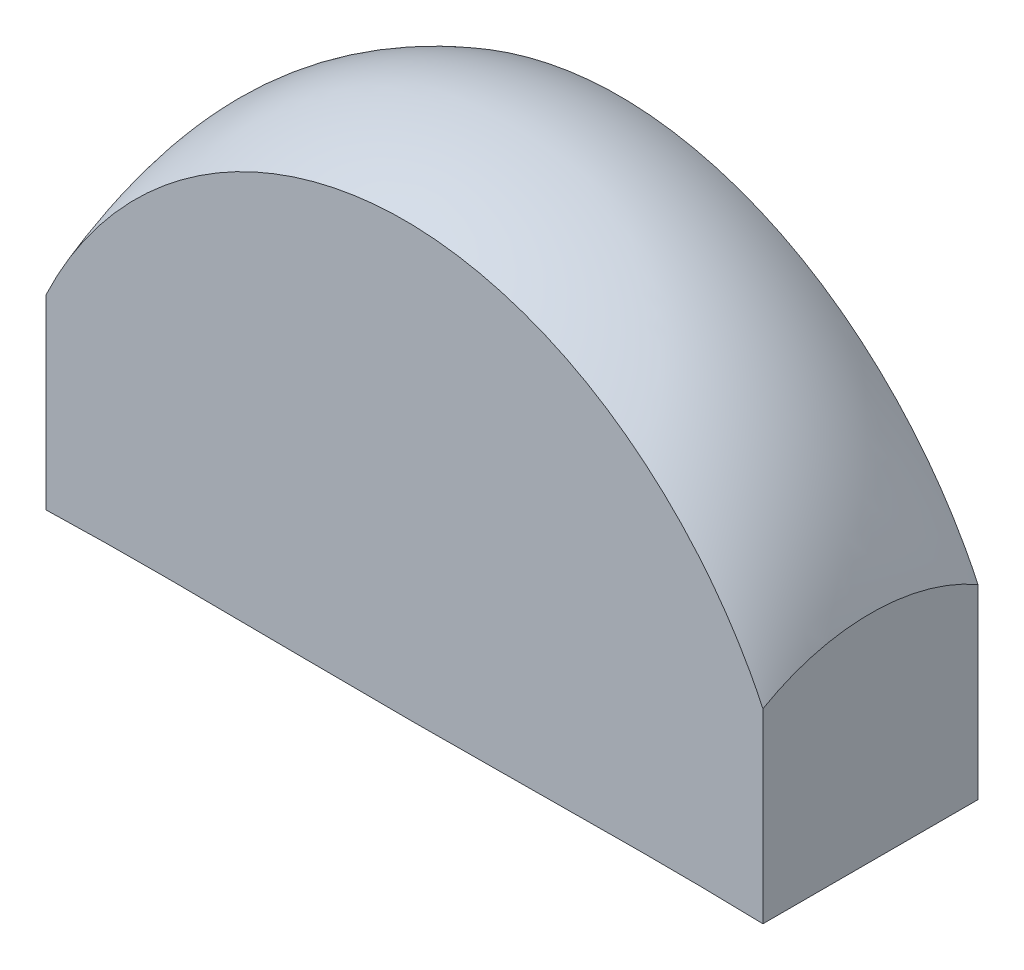
ISO-10303-21;
HEADER;
FILE_DESCRIPTION(('STEP AP214'),'2;1');
FILE_NAME('part.step','',(''),(''),'','','');
FILE_SCHEMA(('AUTOMOTIVE_DESIGN { 1 0 10303 214 1 1 1 1 }'));
ENDSEC;
DATA;
#1=APPLICATION_CONTEXT('core data for automotive mechanical design processes');
#2=APPLICATION_PROTOCOL_DEFINITION('international standard','automotive_design',2000,#1);
#3=PRODUCT_CONTEXT('',#1,'mechanical');
#4=PRODUCT('Part','Part','',(#3));
#5=PRODUCT_RELATED_PRODUCT_CATEGORY('part','',(#4));
#6=PRODUCT_DEFINITION_FORMATION('','',#4);
#7=PRODUCT_DEFINITION_CONTEXT('part definition',#1,'design');
#8=PRODUCT_DEFINITION('design','',#6,#7);
#9=PRODUCT_DEFINITION_SHAPE('','',#8);
#10=(LENGTH_UNIT() NAMED_UNIT(*) SI_UNIT(.MILLI.,.METRE.));
#11=(NAMED_UNIT(*) PLANE_ANGLE_UNIT() SI_UNIT($,.RADIAN.));
#12=(NAMED_UNIT(*) SI_UNIT($,.STERADIAN.) SOLID_ANGLE_UNIT());
#13=UNCERTAINTY_MEASURE_WITH_UNIT(LENGTH_MEASURE(1.E-05),#10,'distance_accuracy_value','');
#14=(GEOMETRIC_REPRESENTATION_CONTEXT(3) GLOBAL_UNCERTAINTY_ASSIGNED_CONTEXT((#13)) GLOBAL_UNIT_ASSIGNED_CONTEXT((#10,
#11,#12)) REPRESENTATION_CONTEXT('',''));
#15=CARTESIAN_POINT('',(0.,0.,0.));
#16=DIRECTION('',(0.,0.,1.));
#17=DIRECTION('',(1.,0.,0.));
#18=AXIS2_PLACEMENT_3D('',#15,#16,#17);
#19=CARTESIAN_POINT('',(100.,0.,0.));
#20=DIRECTION('',(1.,0.,0.));
#21=DIRECTION('',(0.,0.,-1.));
#22=AXIS2_PLACEMENT_3D('',#19,#20,#21);
#23=PLANE('',#22);
#24=DIRECTION('',(0.,1.,0.));
#25=VECTOR('',#24,1.);
#26=CARTESIAN_POINT('',(100.,0.,-15.));
#27=LINE('',#26,#25);
#28=CARTESIAN_POINT('',(100.,0.,-15.));
#29=VERTEX_POINT('',#28);
#30=CARTESIAN_POINT('',(100.,25.9807621135332,-15.));
#31=VERTEX_POINT('',#30);
#32=EDGE_CURVE('E198',#29,#31,#27,.T.);
#33=ORIENTED_EDGE('',*,*,#32,.T.);
#34=CARTESIAN_POINT('',(100.,0.,0.));
#35=DIRECTION('',(1.,0.,0.));
#36=DIRECTION('',(0.,0.,-1.));
#37=AXIS2_PLACEMENT_3D('',#34,#35,#36);
#38=CIRCLE('',#37,30.);
#39=CARTESIAN_POINT('',(100.,25.9807621135332,15.));
#40=VERTEX_POINT('',#39);
#41=EDGE_CURVE('E303',#31,#40,#38,.T.);
#42=ORIENTED_EDGE('',*,*,#41,.T.);
#43=DIRECTION('',(0.,1.,0.));
#44=VECTOR('',#43,1.);
#45=CARTESIAN_POINT('',(100.,0.,15.));
#46=LINE('',#45,#44);
#47=CARTESIAN_POINT('',(100.,0.,15.));
#48=VERTEX_POINT('',#47);
#49=EDGE_CURVE('E156',#48,#40,#46,.T.);
#50=ORIENTED_EDGE('',*,*,#49,.F.);
#51=DIRECTION('',(0.,0.,-1.));
#52=VECTOR('',#51,1.);
#53=CARTESIAN_POINT('',(100.,0.,15.));
#54=LINE('',#53,#52);
#55=EDGE_CURVE('E13',#48,#29,#54,.T.);
#56=ORIENTED_EDGE('',*,*,#55,.T.);
#57=EDGE_LOOP('',(#33,#42,#50,#56));
#58=FACE_BOUND('',#57,.T.);
#59=ADVANCED_FACE('F145',(#58),#23,.T.);
#60=CARTESIAN_POINT('',(0.,0.,0.));
#61=DIRECTION('',(-1.,0.,0.));
#62=DIRECTION('',(0.,0.,1.));
#63=AXIS2_PLACEMENT_3D('',#60,#61,#62);
#64=PLANE('',#63);
#65=DIRECTION('',(0.,1.,0.));
#66=VECTOR('',#65,1.);
#67=CARTESIAN_POINT('',(0.,0.,15.));
#68=LINE('',#67,#66);
#69=CARTESIAN_POINT('',(0.,0.,15.));
#70=VERTEX_POINT('',#69);
#71=CARTESIAN_POINT('',(0.,25.9807621135332,15.));
#72=VERTEX_POINT('',#71);
#73=EDGE_CURVE('E256',#70,#72,#68,.T.);
#74=ORIENTED_EDGE('',*,*,#73,.T.);
#75=CARTESIAN_POINT('',(0.,0.,0.));
#76=DIRECTION('',(-1.,0.,0.));
#77=DIRECTION('',(0.,0.,1.));
#78=AXIS2_PLACEMENT_3D('',#75,#76,#77);
#79=CIRCLE('',#78,30.);
#80=CARTESIAN_POINT('',(0.,25.9807621135332,-15.));
#81=VERTEX_POINT('',#80);
#82=EDGE_CURVE('E214',#72,#81,#79,.T.);
#83=ORIENTED_EDGE('',*,*,#82,.T.);
#84=DIRECTION('',(0.,1.,0.));
#85=VECTOR('',#84,1.);
#86=CARTESIAN_POINT('',(0.,0.,-15.));
#87=LINE('',#86,#85);
#88=CARTESIAN_POINT('',(0.,0.,-15.));
#89=VERTEX_POINT('',#88);
#90=EDGE_CURVE('E195',#89,#81,#87,.T.);
#91=ORIENTED_EDGE('',*,*,#90,.F.);
#92=DIRECTION('',(0.,0.,-1.));
#93=VECTOR('',#92,1.);
#94=CARTESIAN_POINT('',(0.,0.,15.));
#95=LINE('',#94,#93);
#96=EDGE_CURVE('E203',#70,#89,#95,.T.);
#97=ORIENTED_EDGE('',*,*,#96,.F.);
#98=EDGE_LOOP('',(#74,#83,#91,#97));
#99=FACE_BOUND('',#98,.T.);
#100=ADVANCED_FACE('F213',(#99),#64,.T.);
#101=CARTESIAN_POINT('',(0.,25.9807621135332,-15.));
#102=CARTESIAN_POINT('',(3.12234403557291,32.6489417969371,-15.));
#103=CARTESIAN_POINT('',(11.6053060488286,44.6542255606435,-15.));
#104=CARTESIAN_POINT('',(29.0987033197415,56.8856224808324,-15.));
#105=CARTESIAN_POINT('',(50.0000000000007,61.5571887595839,-15.));
#106=CARTESIAN_POINT('',(70.9012966802595,56.8856224808321,-15.));
#107=CARTESIAN_POINT('',(88.3946939511714,44.6542255606437,-15.));
#108=CARTESIAN_POINT('',(96.8776559644271,32.6489417969372,-15.));
#109=CARTESIAN_POINT('',(100.,25.9807621135332,-15.));
#110=CARTESIAN_POINT('',(0.,26.254775253395,-14.5253953198178));
#111=CARTESIAN_POINT('',(3.09055625997516,32.9732640819557,-14.4608467343613));
#112=CARTESIAN_POINT('',(11.5391838090571,45.0617768000187,-14.3317495634483));
#113=CARTESIAN_POINT('',(29.0433815906168,57.3670883856812,-14.1811361973832));
#114=CARTESIAN_POINT('',(50.0000000000006,62.0628798056542,-14.1165876119267));
#115=CARTESIAN_POINT('',(70.9566184093841,57.367088385681,-14.1811361973832));
#116=CARTESIAN_POINT('',(88.4608161909429,45.0617768000189,-14.3317495634483));
#117=CARTESIAN_POINT('',(96.9094437400249,32.9732640819558,-14.4608467343613));
#118=CARTESIAN_POINT('',(100.,26.254775253395,-14.5253953198178));
#119=CARTESIAN_POINT('',(0.,26.7959731924632,-13.5282885832487));
#120=CARTESIAN_POINT('',(3.02968248284089,33.5730621936593,-13.3855341295006));
#121=CARTESIAN_POINT('',(11.4125593311948,45.7454745764124,-13.1000252220043));
#122=CARTESIAN_POINT('',(28.937440154134,58.1042681967726,-12.7669314965918));
#123=CARTESIAN_POINT('',(50.0000000000006,62.80870876851,-12.6241770428437));
#124=CARTESIAN_POINT('',(71.0625598458669,58.1042681967723,-12.7669314965919));
#125=CARTESIAN_POINT('',(88.5874406688053,45.7454745764126,-13.1000252220042));
#126=CARTESIAN_POINT('',(96.9703175171591,33.5730621936593,-13.3855341295005));
#127=CARTESIAN_POINT('',(100.,26.7959731924631,-13.5282885832487));
#128=CARTESIAN_POINT('',(0.,27.5664648704241,-11.8851137677095));
#129=CARTESIAN_POINT('',(2.94743091273955,34.3858565850394,-11.6912740048707));
#130=CARTESIAN_POINT('',(11.2414665781614,46.5978791045053,-11.3035944791931));
#131=CARTESIAN_POINT('',(28.7942939604898,58.9428908308628,-10.8513016992358));
#132=CARTESIAN_POINT('',(50.0000000000004,63.6221411808309,-10.657461936397));
#133=CARTESIAN_POINT('',(71.2057060395107,58.9428908308626,-10.8513016992358));
#134=CARTESIAN_POINT('',(88.7585334218386,46.5978791045054,-11.303594479193));
#135=CARTESIAN_POINT('',(97.0525690872604,34.3858565850394,-11.6912740048707));
#136=CARTESIAN_POINT('',(100.,27.566464870424,-11.8851137677095));
#137=CARTESIAN_POINT('',(0.,28.2748311090692,-10.0906016594128));
#138=CARTESIAN_POINT('',(2.87519221165467,35.1093443297182,-9.89445898646243));
#139=CARTESIAN_POINT('',(11.0912017476064,47.3120920586174,-9.50217364056162));
#140=CARTESIAN_POINT('',(28.6685736237066,59.5935927924681,-9.04450740367725));
#141=CARTESIAN_POINT('',(50.0000000000005,64.2286879445188,-8.84836473072686));
#142=CARTESIAN_POINT('',(71.331426376294,59.593592792468,-9.0445074036773));
#143=CARTESIAN_POINT('',(88.9087982523938,47.3120920586175,-9.50217364056155));
#144=CARTESIAN_POINT('',(97.1248077883455,35.1093443297182,-9.89445898646241));
#145=CARTESIAN_POINT('',(100.,28.2748311090692,-10.0906016594128));
#146=CARTESIAN_POINT('',(0.,28.8919589723556,-8.16811682491327));
#147=CARTESIAN_POINT('',(2.81392015300254,35.7297883029387,-8.00078143771835));
#148=CARTESIAN_POINT('',(10.9637487982475,47.9056496933095,-7.6661106633285));
#149=CARTESIAN_POINT('',(28.5619390395645,60.1110916210149,-7.27566142654027));
#150=CARTESIAN_POINT('',(50.0000000000002,64.6992250454049,-7.10832603934536));
#151=CARTESIAN_POINT('',(71.4380609604358,60.1110916210148,-7.27566142654032));
#152=CARTESIAN_POINT('',(89.0362512017526,47.9056496933095,-7.66611066332844));
#153=CARTESIAN_POINT('',(97.1860798469976,35.7297883029387,-8.00078143771832));
#154=CARTESIAN_POINT('',(100.,28.8919589723556,-8.16811682491326));
#155=CARTESIAN_POINT('',(0.,29.3887355242406,-6.14102383076521));
#156=CARTESIAN_POINT('',(2.76456851019961,36.2256014631852,-6.02389869620077));
#157=CARTESIAN_POINT('',(10.8610916888031,48.3725385128664,-5.78964842707188));
#158=CARTESIAN_POINT('',(28.4760501038443,60.508238633217,-5.51635644642146));
#159=CARTESIAN_POINT('',(50.0000000000002,65.0549123298494,-5.39923131185702));
#160=CARTESIAN_POINT('',(71.523949896156,60.5082386332169,-5.51635644642149));
#161=CARTESIAN_POINT('',(89.138908311197,48.3725385128664,-5.78964842707184));
#162=CARTESIAN_POINT('',(97.2354314898005,36.2256014631852,-6.02389869620075));
#163=CARTESIAN_POINT('',(100.,29.3887355242406,-6.1410238307652));
#164=CARTESIAN_POINT('',(0.,29.7489356175491,-4.06535793203454));
#165=CARTESIAN_POINT('',(2.7280910566622,36.5855450060605,-4.00406258346366));
#166=CARTESIAN_POINT('',(10.785214377991,48.7120141551924,-3.8814718863219));
#167=CARTESIAN_POINT('',(28.4125667123264,60.7972286586586,-3.73844940632315));
#168=CARTESIAN_POINT('',(50.0000000000002,65.3137136053337,-3.67715405775228));
#169=CARTESIAN_POINT('',(71.5874332876738,60.7972286586586,-3.73844940632317));
#170=CARTESIAN_POINT('',(89.214785622009,48.7120141551924,-3.88147188632188));
#171=CARTESIAN_POINT('',(97.2719089433377,36.5855450060604,-4.00406258346366));
#172=CARTESIAN_POINT('',(99.9999999999999,29.7489356175491,-4.06535793203454));
#173=CARTESIAN_POINT('',(0.,29.9563341051062,-1.99715438378717));
#174=CARTESIAN_POINT('',(2.70544156580665,36.7957847762619,-1.98244385636733));
#175=CARTESIAN_POINT('',(10.7381008245293,48.9155462054761,-1.95302280152764));
#176=CARTESIAN_POINT('',(28.3731487607912,60.9764146554293,-1.918698237548));
#177=CARTESIAN_POINT('',(50.0000000000001,65.477155456939,-1.90398771012816));
#178=CARTESIAN_POINT('',(71.6268512392089,60.9764146554293,-1.91869823754801));
#179=CARTESIAN_POINT('',(89.2618991754708,48.9155462054761,-1.95302280152764));
#180=CARTESIAN_POINT('',(97.2945584341933,36.7957847762619,-1.98244385636733));
#181=CARTESIAN_POINT('',(99.9999999999999,29.9563341051062,-1.99715438378717));
#182=CARTESIAN_POINT('',(0.,30.,-0.654498463059296));
#183=CARTESIAN_POINT('',(2.70019639596844,36.841379922893,-0.654498463059296));
#184=CARTESIAN_POINT('',(10.7271902662671,48.9621305129254,-0.654498463059296));
#185=CARTESIAN_POINT('',(28.3640203502765,61.0203271936251,-0.654498463059295));
#186=CARTESIAN_POINT('',(50.,65.5186932328877,-0.654498463059295));
#187=CARTESIAN_POINT('',(71.6359796497235,61.0203271936251,-0.654498463059295));
#188=CARTESIAN_POINT('',(89.272809733733,48.9621305129254,-0.654498463059296));
#189=CARTESIAN_POINT('',(97.2998036040316,36.841379922893,-0.654498463059296));
#190=CARTESIAN_POINT('',(100.,30.,-0.654498463059293));
#191=CARTESIAN_POINT('',(0.,30.,0.));
#192=CARTESIAN_POINT('',(2.70019639596844,36.841379922893,0.));
#193=CARTESIAN_POINT('',(10.7271902662671,48.9621305129254,0.));
#194=CARTESIAN_POINT('',(28.3640203502765,61.0203271936251,0.));
#195=CARTESIAN_POINT('',(50.,65.5186932328877,0.));
#196=CARTESIAN_POINT('',(71.6359796497235,61.0203271936251,0.));
#197=CARTESIAN_POINT('',(89.272809733733,48.9621305129254,0.));
#198=CARTESIAN_POINT('',(97.2998036040316,36.841379922893,0.));
#199=CARTESIAN_POINT('',(100.,30.,0.));
#200=CARTESIAN_POINT('',(0.,30.,0.654498463059296));
#201=CARTESIAN_POINT('',(2.70019639596844,36.841379922893,0.654498463059297));
#202=CARTESIAN_POINT('',(10.7271902662671,48.9621305129254,0.654498463059297));
#203=CARTESIAN_POINT('',(28.3640203502765,61.0203271936251,0.654498463059296));
#204=CARTESIAN_POINT('',(50.,65.5186932328877,0.654498463059296));
#205=CARTESIAN_POINT('',(71.6359796497235,61.0203271936251,0.654498463059296));
#206=CARTESIAN_POINT('',(89.272809733733,48.9621305129254,0.654498463059297));
#207=CARTESIAN_POINT('',(97.2998036040316,36.841379922893,0.654498463059297));
#208=CARTESIAN_POINT('',(100.,30.,0.6544984630593));
#209=CARTESIAN_POINT('',(0.,29.9563341051062,1.99715438378717));
#210=CARTESIAN_POINT('',(2.70544156580665,36.795784776262,1.98244385636733));
#211=CARTESIAN_POINT('',(10.7381008245292,48.9155462054761,1.95302280152765));
#212=CARTESIAN_POINT('',(28.3731487607911,60.9764146554294,1.91869823754802));
#213=CARTESIAN_POINT('',(50.0000000000001,65.477155456939,1.90398771012818));
#214=CARTESIAN_POINT('',(71.6268512392089,60.9764146554293,1.91869823754802));
#215=CARTESIAN_POINT('',(89.2618991754708,48.9155462054761,1.95302280152764));
#216=CARTESIAN_POINT('',(97.2945584341934,36.7957847762619,1.98244385636733));
#217=CARTESIAN_POINT('',(100.,29.9563341051062,1.99715438378717));
#218=CARTESIAN_POINT('',(0.,29.748935617549,4.06535793203454));
#219=CARTESIAN_POINT('',(2.72809105666217,36.5855450060604,4.00406258346366));
#220=CARTESIAN_POINT('',(10.7852143779909,48.7120141551924,3.88147188632189));
#221=CARTESIAN_POINT('',(28.4125667123262,60.7972286586585,3.73844940632314));
#222=CARTESIAN_POINT('',(50.,65.3137136053337,3.67715405775226));
#223=CARTESIAN_POINT('',(71.5874332876736,60.7972286586585,3.73844940632315));
#224=CARTESIAN_POINT('',(89.2147856220091,48.7120141551924,3.88147188632187));
#225=CARTESIAN_POINT('',(97.2719089433379,36.5855450060604,4.00406258346365));
#226=CARTESIAN_POINT('',(100.,29.748935617549,4.06535793203454));
#227=CARTESIAN_POINT('',(0.,29.3887355242405,6.14102383076519));
#228=CARTESIAN_POINT('',(2.76456851019961,36.2256014631852,6.02389869620075));
#229=CARTESIAN_POINT('',(10.861091688803,48.3725385128664,5.78964842707188));
#230=CARTESIAN_POINT('',(28.4760501038442,60.508238633217,5.51635644642147));
#231=CARTESIAN_POINT('',(50.0000000000001,65.0549123298495,5.39923131185704));
#232=CARTESIAN_POINT('',(71.5239498961558,60.508238633217,5.51635644642151));
#233=CARTESIAN_POINT('',(89.138908311197,48.3725385128664,5.78964842707184));
#234=CARTESIAN_POINT('',(97.2354314898004,36.2256014631852,6.02389869620074));
#235=CARTESIAN_POINT('',(100.,29.3887355242405,6.1410238307652));
#236=CARTESIAN_POINT('',(0.,28.8919589723556,8.16811682491325));
#237=CARTESIAN_POINT('',(2.81392015300254,35.7297883029387,8.00078143771833));
#238=CARTESIAN_POINT('',(10.9637487982475,47.9056496933095,7.66611066332848));
#239=CARTESIAN_POINT('',(28.5619390395644,60.1110916210148,7.27566142654026));
#240=CARTESIAN_POINT('',(50.0000000000001,64.6992250454048,7.10832603934536));
#241=CARTESIAN_POINT('',(71.4380609604355,60.1110916210147,7.27566142654031));
#242=CARTESIAN_POINT('',(89.0362512017525,47.9056496933095,7.66611066332844));
#243=CARTESIAN_POINT('',(97.1860798469974,35.7297883029387,8.00078143771832));
#244=CARTESIAN_POINT('',(99.9999999999999,28.8919589723556,8.16811682491326));
#245=CARTESIAN_POINT('',(0.,28.2748311090691,10.0906016594128));
#246=CARTESIAN_POINT('',(2.87519221165464,35.1093443297182,9.89445898646242));
#247=CARTESIAN_POINT('',(11.0912017476063,47.3120920586175,9.50217364056161));
#248=CARTESIAN_POINT('',(28.6685736237065,59.5935927924682,9.04450740367724));
#249=CARTESIAN_POINT('',(50.0000000000002,64.2286879445188,8.84836473072685));
#250=CARTESIAN_POINT('',(71.3314263762937,59.593592792468,9.0445074036773));
#251=CARTESIAN_POINT('',(88.9087982523937,47.3120920586176,9.50217364056155));
#252=CARTESIAN_POINT('',(97.1248077883454,35.1093443297182,9.8944589864624));
#253=CARTESIAN_POINT('',(100.,28.2748311090691,10.0906016594128));
#254=CARTESIAN_POINT('',(0.,27.566464870424,11.8851137677095));
#255=CARTESIAN_POINT('',(2.94743091273952,34.3858565850394,11.6912740048707));
#256=CARTESIAN_POINT('',(11.2414665781613,46.5978791045053,11.3035944791931));
#257=CARTESIAN_POINT('',(28.7942939604897,58.9428908308627,10.8513016992358));
#258=CARTESIAN_POINT('',(50.0000000000002,63.6221411808309,10.657461936397));
#259=CARTESIAN_POINT('',(71.2057060395104,58.9428908308625,10.8513016992358));
#260=CARTESIAN_POINT('',(88.7585334218386,46.5978791045054,11.303594479193));
#261=CARTESIAN_POINT('',(97.0525690872605,34.3858565850394,11.6912740048706));
#262=CARTESIAN_POINT('',(100.,27.566464870424,11.8851137677095));
#263=CARTESIAN_POINT('',(0.,26.7959731924632,13.5282885832487));
#264=CARTESIAN_POINT('',(3.02968248284087,33.5730621936593,13.3855341295005));
#265=CARTESIAN_POINT('',(11.4125593311947,45.7454745764125,13.1000252220043));
#266=CARTESIAN_POINT('',(28.9374401541337,58.1042681967726,12.7669314965918));
#267=CARTESIAN_POINT('',(50.0000000000003,62.80870876851,12.6241770428437));
#268=CARTESIAN_POINT('',(71.0625598458666,58.1042681967724,12.7669314965919));
#269=CARTESIAN_POINT('',(88.5874406688053,45.7454745764126,13.1000252220042));
#270=CARTESIAN_POINT('',(96.9703175171592,33.5730621936593,13.3855341295005));
#271=CARTESIAN_POINT('',(100.,26.7959731924632,13.5282885832487));
#272=CARTESIAN_POINT('',(0.,26.254775253395,14.5253953198178));
#273=CARTESIAN_POINT('',(3.09055625997513,32.9732640819557,14.4608467343613));
#274=CARTESIAN_POINT('',(11.539183809057,45.0617768000187,14.3317495634483));
#275=CARTESIAN_POINT('',(29.0433815906166,57.3670883856813,14.1811361973832));
#276=CARTESIAN_POINT('',(50.0000000000003,62.0628798056542,14.1165876119267));
#277=CARTESIAN_POINT('',(70.9566184093838,57.367088385681,14.1811361973832));
#278=CARTESIAN_POINT('',(88.4608161909429,45.061776800019,14.3317495634483));
#279=CARTESIAN_POINT('',(96.9094437400249,32.9732640819558,14.4608467343613));
#280=CARTESIAN_POINT('',(100.,26.254775253395,14.5253953198178));
#281=CARTESIAN_POINT('',(0.,25.9807621135332,15.));
#282=CARTESIAN_POINT('',(3.12234403557289,32.6489417969371,15.));
#283=CARTESIAN_POINT('',(11.6053060488286,44.6542255606435,15.));
#284=CARTESIAN_POINT('',(29.0987033197413,56.8856224808324,15.));
#285=CARTESIAN_POINT('',(50.0000000000004,61.5571887595839,15.));
#286=CARTESIAN_POINT('',(70.9012966802591,56.8856224808321,15.));
#287=CARTESIAN_POINT('',(88.3946939511714,44.6542255606437,15.));
#288=CARTESIAN_POINT('',(96.8776559644271,32.6489417969372,15.));
#289=CARTESIAN_POINT('',(100.,25.9807621135332,15.));
#290=B_SPLINE_SURFACE_WITH_KNOTS('',3,3,((#101,#102,#103,#104,#105,#106,#107,#108,#109),(#110,
#111,#112,#113,#114,#115,#116,#117,#118),(#119,#120,#121,#122,#123,#124,#125,#126,#127),(#128,
#129,#130,#131,#132,#133,#134,#135,#136),(#137,#138,#139,#140,#141,#142,#143,#144,#145),(#146,
#147,#148,#149,#150,#151,#152,#153,#154),(#155,#156,#157,#158,#159,#160,#161,#162,#163),(#164,
#165,#166,#167,#168,#169,#170,#171,#172),(#173,#174,#175,#176,#177,#178,#179,#180,#181),(#182,
#183,#184,#185,#186,#187,#188,#189,#190),(#191,#192,#193,#194,#195,#196,#197,#198,#199),(#200,
#201,#202,#203,#204,#205,#206,#207,#208),(#209,#210,#211,#212,#213,#214,#215,#216,#217),(#218,
#219,#220,#221,#222,#223,#224,#225,#226),(#227,#228,#229,#230,#231,#232,#233,#234,#235),(#236,
#237,#238,#239,#240,#241,#242,#243,#244),(#245,#246,#247,#248,#249,#250,#251,#252,#253),(#254,
#255,#256,#257,#258,#259,#260,#261,#262),(#263,#264,#265,#266,#267,#268,#269,#270,#271),(#272,
#273,#274,#275,#276,#277,#278,#279,#280),(#281,#282,#283,#284,#285,#286,#287,#288,#289)),
.UNSPECIFIED.,.F.,.F.,.F.,(4,1,1,1,1,1,1,1,3,1,1,1,1,1,1,1,4),(4,1,1,1,1,1,4),
(0.757548768160034,0.772701970150032,0.78785517214003,0.803008374130028,0.818161576120026,
0.833314778110024,0.848467980100022,0.863621182090019,0.878774384080017,0.893927586070015,
0.909080788060013,0.924233990050011,0.939387192040009,0.954540394030007,0.969693596020004,
0.984846798010002,1.),(0.,0.166666666666667,0.333333333333333,0.500000000000072,
0.666666666666667,0.833333333333333,1.),.UNSPECIFIED.);
#291=CARTESIAN_POINT('',(0.,25.9807621135332,15.));
#292=CARTESIAN_POINT('',(3.12234403557289,32.6489417969371,15.));
#293=CARTESIAN_POINT('',(11.6053060488286,44.6542255606435,15.));
#294=CARTESIAN_POINT('',(29.0987033197413,56.8856224808324,15.));
#295=CARTESIAN_POINT('',(50.0000000000004,61.5571887595839,15.));
#296=CARTESIAN_POINT('',(70.9012966802591,56.8856224808321,15.));
#297=CARTESIAN_POINT('',(88.3946939511714,44.6542255606437,15.));
#298=CARTESIAN_POINT('',(96.8776559644271,32.6489417969372,15.));
#299=CARTESIAN_POINT('',(100.,25.9807621135332,15.));
#300=B_SPLINE_CURVE_WITH_KNOTS('',3,(#291,#292,#293,#294,#295,#296,#297,#298,#299),
.UNSPECIFIED.,.F.,.F.,(4,1,1,1,1,1,4),(0.,0.166666666666667,0.333333333333333,0.500000000000072,
0.666666666666667,0.833333333333333,1.),.UNSPECIFIED.);
#301=EDGE_CURVE('E345',#72,#40,#300,.T.);
#302=CARTESIAN_POINT('',(0.,25.9807621135332,-15.));
#303=CARTESIAN_POINT('',(3.12234403557291,32.6489417969371,-15.));
#304=CARTESIAN_POINT('',(11.6053060488286,44.6542255606435,-15.));
#305=CARTESIAN_POINT('',(29.0987033197415,56.8856224808324,-15.));
#306=CARTESIAN_POINT('',(50.0000000000007,61.5571887595839,-15.));
#307=CARTESIAN_POINT('',(70.9012966802595,56.8856224808321,-15.));
#308=CARTESIAN_POINT('',(88.3946939511714,44.6542255606437,-15.));
#309=CARTESIAN_POINT('',(96.8776559644271,32.6489417969372,-15.));
#310=CARTESIAN_POINT('',(100.,25.9807621135332,-15.));
#311=B_SPLINE_CURVE_WITH_KNOTS('',3,(#302,#303,#304,#305,#306,#307,#308,#309,#310),
.UNSPECIFIED.,.F.,.F.,(4,1,1,1,1,1,4),(0.,0.166666666666667,0.333333333333333,0.500000000000072,
0.666666666666667,0.833333333333333,1.),.UNSPECIFIED.);
#312=EDGE_CURVE('E201',#81,#31,#311,.T.);
#313=ORIENTED_EDGE('',*,*,#82,.F.);
#314=ORIENTED_EDGE('',*,*,#301,.T.);
#315=ORIENTED_EDGE('',*,*,#41,.F.);
#316=ORIENTED_EDGE('',*,*,#312,.F.);
#317=EDGE_LOOP('',(#313,#314,#315,#316));
#318=FACE_BOUND('',#317,.T.);
#319=ADVANCED_FACE('F233',(#318),#290,.T.);
#320=CARTESIAN_POINT('',(0.,0.,-15.));
#321=DIRECTION('',(0.,0.,-1.));
#322=DIRECTION('',(0.,1.,0.));
#323=AXIS2_PLACEMENT_3D('',#320,#321,#322);
#324=PLANE('',#323);
#325=ORIENTED_EDGE('',*,*,#90,.T.);
#326=ORIENTED_EDGE('',*,*,#312,.T.);
#327=ORIENTED_EDGE('',*,*,#32,.F.);
#328=CARTESIAN_POINT('',(0.,0.,-15.));
#329=CARTESIAN_POINT('',(5.16725805801291,0.159312082451496,-15.));
#330=CARTESIAN_POINT('',(15.8589630840035,0.265520137419212,-15.));
#331=CARTESIAN_POINT('',(32.6575613242877,0.106208054967527,-15.));
#332=CARTESIAN_POINT('',(50.0000000000022,-0.0531040274838209,-15.));
#333=CARTESIAN_POINT('',(67.3424386757166,0.106208054967747,-15.));
#334=CARTESIAN_POINT('',(84.1410369159966,0.265520137418985,-15.));
#335=CARTESIAN_POINT('',(94.8327419419871,0.159312082451419,-15.));
#336=CARTESIAN_POINT('',(100.,0.,-15.));
#337=B_SPLINE_CURVE_WITH_KNOTS('',3,(#328,#329,#330,#331,#332,#333,#334,#335,#336),
.UNSPECIFIED.,.F.,.F.,(4,1,1,1,1,1,4),(0.,0.166666666666667,0.333333333333333,0.500000000000072,
0.666666666666667,0.833333333333333,1.),.UNSPECIFIED.);
#338=EDGE_CURVE('E190',#89,#29,#337,.T.);
#339=ORIENTED_EDGE('',*,*,#338,.F.);
#340=EDGE_LOOP('',(#325,#326,#327,#339));
#341=FACE_BOUND('',#340,.T.);
#342=ADVANCED_FACE('F192',(#341),#324,.T.);
#343=CARTESIAN_POINT('',(0.,0.,15.));
#344=CARTESIAN_POINT('',(5.16725805801291,0.159312082451496,15.));
#345=CARTESIAN_POINT('',(15.8589630840034,0.265520137419213,15.));
#346=CARTESIAN_POINT('',(32.6575613242876,0.106208054967527,15.));
#347=CARTESIAN_POINT('',(50.0000000000021,-0.053104027483821,15.));
#348=CARTESIAN_POINT('',(67.3424386757165,0.106208054967746,15.));
#349=CARTESIAN_POINT('',(84.1410369159966,0.265520137418985,15.));
#350=CARTESIAN_POINT('',(94.8327419419871,0.159312082451419,15.));
#351=CARTESIAN_POINT('',(100.,0.,15.));
#352=CARTESIAN_POINT('',(0.,0.,13.9562800968171));
#353=CARTESIAN_POINT('',(5.22606826161693,0.135183222325312,13.8118767481806));
#354=CARTESIAN_POINT('',(15.9812950909021,0.225305370542231,13.5230700509077));
#355=CARTESIAN_POINT('',(32.7599114287656,0.0901221482167582,13.1861289040891));
#356=CARTESIAN_POINT('',(50.0000000000021,-0.045061074108428,13.0417255554527));
#357=CARTESIAN_POINT('',(67.2400885712386,0.0901221482169444,13.1861289040892));
#358=CARTESIAN_POINT('',(84.0187049090979,0.225305370542038,13.5230700509076));
#359=CARTESIAN_POINT('',(94.7739317383831,0.135183222325246,13.8118767481806));
#360=CARTESIAN_POINT('',(100.,0.,13.9562800968171));
#361=CARTESIAN_POINT('',(0.,0.,11.7230431779217));
#362=CARTESIAN_POINT('',(5.33341565241379,0.0911403518926906,11.5064436528131));
#363=CARTESIAN_POINT('',(16.2045900456337,0.151900586487848,11.0732446025959));
#364=CARTESIAN_POINT('',(32.9467330343746,0.0607602345950486,10.5678457106757));
#365=CARTESIAN_POINT('',(50.0000000000022,-0.0303801172975573,10.3512461855672));
#366=CARTESIAN_POINT('',(67.0532669656298,0.0607602345951741,10.5678457106758));
#367=CARTESIAN_POINT('',(83.7954099543662,0.151900586487718,11.0732446025958));
#368=CARTESIAN_POINT('',(94.6665843475862,0.0911403518926463,11.5064436528131));
#369=CARTESIAN_POINT('',(99.9999999999999,0.,11.7230431779217));
#370=CARTESIAN_POINT('',(0.,0.,7.93300795377042));
#371=CARTESIAN_POINT('',(5.45697338764077,0.0404466435206986,7.75346204978081));
#372=CARTESIAN_POINT('',(16.4616043865454,0.0674110725345111,7.3943702418016));
#373=CARTESIAN_POINT('',(33.1617662485884,0.0269644290137643,6.97542979915911));
#374=CARTESIAN_POINT('',(50.0000000000023,-0.0134822145068968,6.79588389516952));
#375=CARTESIAN_POINT('',(66.8382337514163,0.02696442901382,6.97542979915916));
#376=CARTESIAN_POINT('',(83.5383956134547,0.0674110725344533,7.39437024180154));
#377=CARTESIAN_POINT('',(94.5430266123594,0.040446643520679,7.75346204978079));
#378=CARTESIAN_POINT('',(100.,0.,7.93300795377041));
#379=CARTESIAN_POINT('',(0.,0.,3.87995120902285));
#380=CARTESIAN_POINT('',(5.53642347016474,0.00784958024334488,3.82712715470313));
#381=CARTESIAN_POINT('',(16.6268697222831,0.0130826337389107,3.7214790460637));
#382=CARTESIAN_POINT('',(33.3000368844437,0.0052330534955565,3.59822291931768));
#383=CARTESIAN_POINT('',(50.0000000000024,-0.00261652674778109,3.54539886499797));
#384=CARTESIAN_POINT('',(66.6999631155611,0.0052330534955673,3.59822291931769));
#385=CARTESIAN_POINT('',(83.3731302777169,0.0130826337388995,3.72147904606369));
#386=CARTESIAN_POINT('',(94.4635765298353,0.00784958024334106,3.82712715470314));
#387=CARTESIAN_POINT('',(100.,0.,3.87995120902286));
#388=CARTESIAN_POINT('',(0.,0.,1.25));
#389=CARTESIAN_POINT('',(5.55555555555555,0.,1.25));
#390=CARTESIAN_POINT('',(16.6666666666667,0.,1.25));
#391=CARTESIAN_POINT('',(33.3333333333357,0.,1.25));
#392=CARTESIAN_POINT('',(50.0000000000024,0.,1.25));
#393=CARTESIAN_POINT('',(66.6666666666691,0.,1.25));
#394=CARTESIAN_POINT('',(83.3333333333333,0.,1.25));
#395=CARTESIAN_POINT('',(94.4444444444445,0.,1.25));
#396=CARTESIAN_POINT('',(100.,0.,1.25));
#397=CARTESIAN_POINT('',(0.,0.,-1.25));
#398=CARTESIAN_POINT('',(5.55555555555555,0.,-1.25));
#399=CARTESIAN_POINT('',(16.6666666666667,0.,-1.25));
#400=CARTESIAN_POINT('',(33.3333333333357,0.,-1.25));
#401=CARTESIAN_POINT('',(50.0000000000024,0.,-1.25));
#402=CARTESIAN_POINT('',(66.6666666666691,0.,-1.25));
#403=CARTESIAN_POINT('',(83.3333333333333,0.,-1.25));
#404=CARTESIAN_POINT('',(94.4444444444445,0.,-1.25));
#405=CARTESIAN_POINT('',(100.,0.,-1.25));
#406=CARTESIAN_POINT('',(0.,0.,-3.87995120902284));
#407=CARTESIAN_POINT('',(5.53642347016474,0.00784958024334486,-3.82712715470313));
#408=CARTESIAN_POINT('',(16.6268697222831,0.0130826337389107,-3.72147904606369));
#409=CARTESIAN_POINT('',(33.3000368844438,0.00523305349555649,-3.59822291931767));
#410=CARTESIAN_POINT('',(50.0000000000024,-0.00261652674778108,-3.54539886499796));
#411=CARTESIAN_POINT('',(66.6999631155611,0.00523305349556732,-3.59822291931769));
#412=CARTESIAN_POINT('',(83.3731302777169,0.0130826337388995,-3.72147904606369));
#413=CARTESIAN_POINT('',(94.4635765298353,0.0078495802433411,-3.82712715470313));
#414=CARTESIAN_POINT('',(100.,0.,-3.87995120902286));
#415=CARTESIAN_POINT('',(0.,0.,-7.93300795377042));
#416=CARTESIAN_POINT('',(5.45697338764077,0.0404466435206986,-7.75346204978081));
#417=CARTESIAN_POINT('',(16.4616043865454,0.0674110725345109,-7.3943702418016));
#418=CARTESIAN_POINT('',(33.1617662485884,0.0269644290137642,-6.9754297991591));
#419=CARTESIAN_POINT('',(50.0000000000023,-0.0134822145068967,-6.7958838951695));
#420=CARTESIAN_POINT('',(66.8382337514162,0.02696442901382,-6.97542979915914));
#421=CARTESIAN_POINT('',(83.5383956134546,0.0674110725344532,-7.39437024180153));
#422=CARTESIAN_POINT('',(94.5430266123592,0.0404466435206791,-7.75346204978078));
#423=CARTESIAN_POINT('',(100.,0.,-7.9330079537704));
#424=CARTESIAN_POINT('',(0.,0.,-11.7230431779217));
#425=CARTESIAN_POINT('',(5.33341565241379,0.0911403518926904,-11.5064436528131));
#426=CARTESIAN_POINT('',(16.2045900456337,0.151900586487847,-11.0732446025959));
#427=CARTESIAN_POINT('',(32.9467330343746,0.0607602345950485,-10.5678457106757));
#428=CARTESIAN_POINT('',(50.0000000000023,-0.0303801172975572,-10.3512461855672));
#429=CARTESIAN_POINT('',(67.0532669656299,0.0607602345951743,-10.5678457106758));
#430=CARTESIAN_POINT('',(83.7954099543663,0.151900586487717,-11.0732446025958));
#431=CARTESIAN_POINT('',(94.6665843475863,0.0911403518926467,-11.5064436528131));
#432=CARTESIAN_POINT('',(100.,0.,-11.7230431779217));
#433=CARTESIAN_POINT('',(0.,0.,-13.9562800968171));
#434=CARTESIAN_POINT('',(5.22606826161694,0.135183222325312,-13.8118767481806));
#435=CARTESIAN_POINT('',(15.9812950909021,0.225305370542231,-13.5230700509077));
#436=CARTESIAN_POINT('',(32.7599114287656,0.0901221482167581,-13.1861289040891));
#437=CARTESIAN_POINT('',(50.0000000000022,-0.0450610741084279,-13.0417255554527));
#438=CARTESIAN_POINT('',(67.2400885712387,0.0901221482169446,-13.1861289040892));
#439=CARTESIAN_POINT('',(84.0187049090979,0.225305370542038,-13.5230700509076));
#440=CARTESIAN_POINT('',(94.7739317383831,0.135183222325247,-13.8118767481806));
#441=CARTESIAN_POINT('',(100.,0.,-13.9562800968171));
#442=CARTESIAN_POINT('',(0.,0.,-15.));
#443=CARTESIAN_POINT('',(5.16725805801291,0.159312082451496,-15.));
#444=CARTESIAN_POINT('',(15.8589630840035,0.265520137419212,-15.));
#445=CARTESIAN_POINT('',(32.6575613242877,0.106208054967527,-15.));
#446=CARTESIAN_POINT('',(50.0000000000022,-0.0531040274838209,-15.));
#447=CARTESIAN_POINT('',(67.3424386757166,0.106208054967747,-15.));
#448=CARTESIAN_POINT('',(84.1410369159966,0.265520137418985,-15.));
#449=CARTESIAN_POINT('',(94.8327419419871,0.159312082451419,-15.));
#450=CARTESIAN_POINT('',(100.,0.,-15.));
#451=B_SPLINE_SURFACE_WITH_KNOTS('',3,3,((#343,#344,#345,#346,#347,#348,#349,#350,#351),(#352,
#353,#354,#355,#356,#357,#358,#359,#360),(#361,#362,#363,#364,#365,#366,#367,#368,#369),(#370,
#371,#372,#373,#374,#375,#376,#377,#378),(#379,#380,#381,#382,#383,#384,#385,#386,#387),(#388,
#389,#390,#391,#392,#393,#394,#395,#396),(#397,#398,#399,#400,#401,#402,#403,#404,#405),(#406,
#407,#408,#409,#410,#411,#412,#413,#414),(#415,#416,#417,#418,#419,#420,#421,#422,#423),(#424,
#425,#426,#427,#428,#429,#430,#431,#432),(#433,#434,#435,#436,#437,#438,#439,#440,#441),(#442,
#443,#444,#445,#446,#447,#448,#449,#450)),.UNSPECIFIED.,.F.,.F.,.F.,(4,1,1,1,2,1,1,1,4),(4,1,1,
1,1,1,4),(0.263012448061868,0.291952932066405,0.320893416070943,0.34983390007548,
0.378774384080017,0.407714868084554,0.436655352089092,0.465595836093629,0.494536320098166),(0.,
0.166666666666667,0.333333333333333,0.500000000000072,0.666666666666667,0.833333333333333,1.),.UNSPECIFIED.);
#452=CARTESIAN_POINT('',(0.,0.,15.));
#453=CARTESIAN_POINT('',(5.16725805801291,0.159312082451496,15.));
#454=CARTESIAN_POINT('',(15.8589630840034,0.265520137419213,15.));
#455=CARTESIAN_POINT('',(32.6575613242876,0.106208054967527,15.));
#456=CARTESIAN_POINT('',(50.0000000000021,-0.053104027483821,15.));
#457=CARTESIAN_POINT('',(67.3424386757165,0.106208054967746,15.));
#458=CARTESIAN_POINT('',(84.1410369159966,0.265520137418985,15.));
#459=CARTESIAN_POINT('',(94.8327419419871,0.159312082451419,15.));
#460=CARTESIAN_POINT('',(100.,0.,15.));
#461=B_SPLINE_CURVE_WITH_KNOTS('',3,(#452,#453,#454,#455,#456,#457,#458,#459,#460),
.UNSPECIFIED.,.F.,.F.,(4,1,1,1,1,1,4),(0.,0.166666666666667,0.333333333333333,0.500000000000072,
0.666666666666667,0.833333333333333,1.),.UNSPECIFIED.);
#462=EDGE_CURVE('E171',#70,#48,#461,.T.);
#463=ORIENTED_EDGE('',*,*,#96,.T.);
#464=ORIENTED_EDGE('',*,*,#338,.T.);
#465=ORIENTED_EDGE('',*,*,#55,.F.);
#466=ORIENTED_EDGE('',*,*,#462,.F.);
#467=EDGE_LOOP('',(#463,#464,#465,#466));
#468=FACE_BOUND('',#467,.T.);
#469=ADVANCED_FACE('F205',(#468),#451,.T.);
#470=CARTESIAN_POINT('',(0.,25.9807621135332,15.));
#471=DIRECTION('',(0.,0.,1.));
#472=DIRECTION('',(0.,-1.,0.));
#473=AXIS2_PLACEMENT_3D('',#470,#471,#472);
#474=PLANE('',#473);
#475=ORIENTED_EDGE('',*,*,#73,.F.);
#476=ORIENTED_EDGE('',*,*,#462,.T.);
#477=ORIENTED_EDGE('',*,*,#49,.T.);
#478=ORIENTED_EDGE('',*,*,#301,.F.);
#479=EDGE_LOOP('',(#475,#476,#477,#478));
#480=FACE_BOUND('',#479,.T.);
#481=ADVANCED_FACE('F147',(#480),#474,.T.);
#482=CLOSED_SHELL('',(#59,#100,#319,#342,#469,#481));
#483=MANIFOLD_SOLID_BREP('B2',#482);
#484=ADVANCED_BREP_SHAPE_REPRESENTATION('',(#18,#483),#14);
#485=SHAPE_DEFINITION_REPRESENTATION(#9,#484);
ENDSEC;
END-ISO-10303-21;
